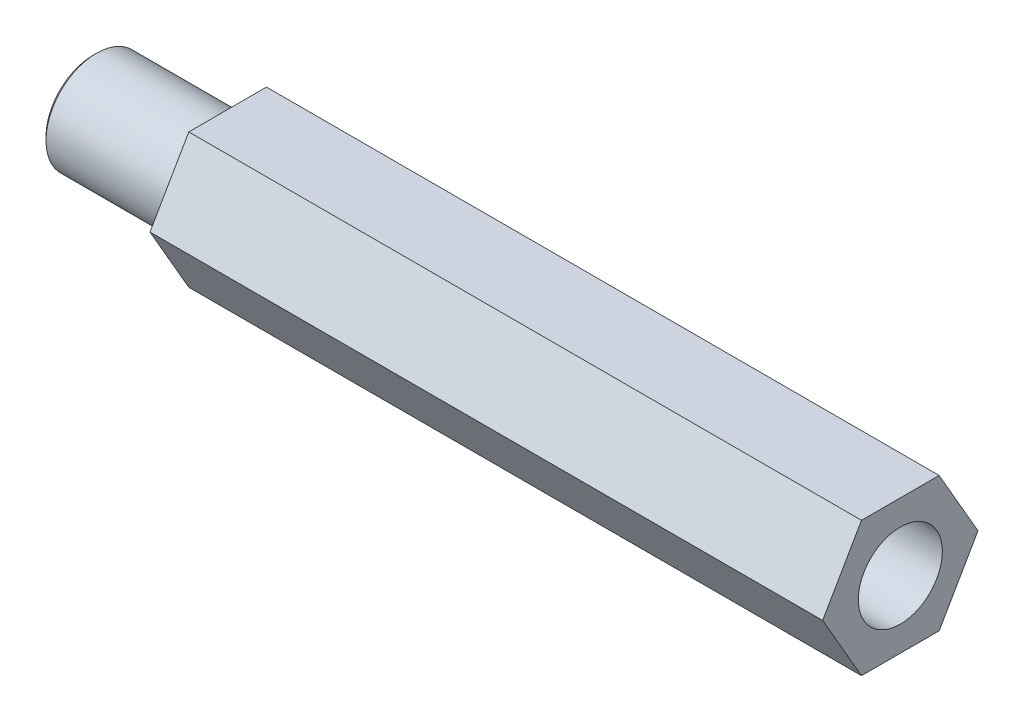
ISO-10303-21;
HEADER;
FILE_DESCRIPTION(('STEP AP214'),'2;1');
FILE_NAME('part.step','',(''),(''),'','','');
FILE_SCHEMA(('AUTOMOTIVE_DESIGN { 1 0 10303 214 1 1 1 1 }'));
ENDSEC;
DATA;
#1=APPLICATION_CONTEXT('core data for automotive mechanical design processes');
#2=APPLICATION_PROTOCOL_DEFINITION('international standard','automotive_design',2000,#1);
#3=PRODUCT_CONTEXT('',#1,'mechanical');
#4=PRODUCT('Part','Part','',(#3));
#5=PRODUCT_RELATED_PRODUCT_CATEGORY('part','',(#4));
#6=PRODUCT_DEFINITION_FORMATION('','',#4);
#7=PRODUCT_DEFINITION_CONTEXT('part definition',#1,'design');
#8=PRODUCT_DEFINITION('design','',#6,#7);
#9=PRODUCT_DEFINITION_SHAPE('','',#8);
#10=(LENGTH_UNIT() NAMED_UNIT(*) SI_UNIT(.MILLI.,.METRE.));
#11=(NAMED_UNIT(*) PLANE_ANGLE_UNIT() SI_UNIT($,.RADIAN.));
#12=(NAMED_UNIT(*) SI_UNIT($,.STERADIAN.) SOLID_ANGLE_UNIT());
#13=UNCERTAINTY_MEASURE_WITH_UNIT(LENGTH_MEASURE(1.E-05),#10,'distance_accuracy_value','');
#14=(GEOMETRIC_REPRESENTATION_CONTEXT(3) GLOBAL_UNCERTAINTY_ASSIGNED_CONTEXT((#13)) GLOBAL_UNIT_ASSIGNED_CONTEXT((#10,
#11,#12)) REPRESENTATION_CONTEXT('',''));
#15=CARTESIAN_POINT('',(0.,0.,0.));
#16=DIRECTION('',(0.,0.,1.));
#17=DIRECTION('',(1.,0.,0.));
#18=AXIS2_PLACEMENT_3D('',#15,#16,#17);
#19=CARTESIAN_POINT('',(0.,0.,0.));
#20=DIRECTION('',(1.,0.,0.));
#21=DIRECTION('',(0.,0.,-1.));
#22=AXIS2_PLACEMENT_3D('',#19,#20,#21);
#23=PLANE('',#22);
#24=DIRECTION('',(0.,0.866025403784439,-0.499999999999999));
#25=VECTOR('',#24,1.);
#26=CARTESIAN_POINT('',(0.,-4.,-2.3094010767585));
#27=LINE('',#26,#25);
#28=CARTESIAN_POINT('',(0.,-4.,-2.3094010767585));
#29=VERTEX_POINT('',#28);
#30=CARTESIAN_POINT('',(0.,0.,-4.618802153517));
#31=VERTEX_POINT('',#30);
#32=EDGE_CURVE('E120',#29,#31,#27,.T.);
#33=ORIENTED_EDGE('',*,*,#32,.F.);
#34=DIRECTION('',(0.,0.,-1.));
#35=VECTOR('',#34,1.);
#36=CARTESIAN_POINT('',(0.,-4.,2.3094010767585));
#37=LINE('',#36,#35);
#38=CARTESIAN_POINT('',(0.,-4.,2.3094010767585));
#39=VERTEX_POINT('',#38);
#40=EDGE_CURVE('E80',#39,#29,#37,.T.);
#41=ORIENTED_EDGE('',*,*,#40,.F.);
#42=DIRECTION('',(0.,-0.866025403784439,-0.5));
#43=VECTOR('',#42,1.);
#44=CARTESIAN_POINT('',(0.,0.,4.61880215351701));
#45=LINE('',#44,#43);
#46=CARTESIAN_POINT('',(0.,0.,4.61880215351701));
#47=VERTEX_POINT('',#46);
#48=EDGE_CURVE('E74',#47,#39,#45,.T.);
#49=ORIENTED_EDGE('',*,*,#48,.F.);
#50=DIRECTION('',(0.,-0.866025403784438,0.5));
#51=VECTOR('',#50,1.);
#52=CARTESIAN_POINT('',(0.,4.,2.3094010767585));
#53=LINE('',#52,#51);
#54=CARTESIAN_POINT('',(0.,4.,2.3094010767585));
#55=VERTEX_POINT('',#54);
#56=EDGE_CURVE('E110',#55,#47,#53,.T.);
#57=ORIENTED_EDGE('',*,*,#56,.F.);
#58=DIRECTION('',(0.,0.,1.));
#59=VECTOR('',#58,1.);
#60=CARTESIAN_POINT('',(0.,4.,-2.3094010767585));
#61=LINE('',#60,#59);
#62=CARTESIAN_POINT('',(0.,4.,-2.3094010767585));
#63=VERTEX_POINT('',#62);
#64=EDGE_CURVE('E126',#63,#55,#61,.T.);
#65=ORIENTED_EDGE('',*,*,#64,.F.);
#66=DIRECTION('',(0.,0.866025403784439,0.5));
#67=VECTOR('',#66,1.);
#68=CARTESIAN_POINT('',(0.,0.,-4.618802153517));
#69=LINE('',#68,#67);
#70=EDGE_CURVE('E123',#31,#63,#69,.T.);
#71=ORIENTED_EDGE('',*,*,#70,.F.);
#72=EDGE_LOOP('',(#33,#41,#49,#57,#65,#71));
#73=FACE_BOUND('',#72,.T.);
#74=CARTESIAN_POINT('',(0.,0.,0.));
#75=DIRECTION('',(1.,0.,0.));
#76=DIRECTION('',(0.,0.,-1.));
#77=AXIS2_PLACEMENT_3D('',#74,#75,#76);
#78=CIRCLE('',#77,3.);
#79=CARTESIAN_POINT('',(0.,0.,-3.));
#80=VERTEX_POINT('',#79);
#81=EDGE_CURVE('E140',#80,#80,#78,.F.);
#82=ORIENTED_EDGE('',*,*,#81,.F.);
#83=EDGE_LOOP('',(#82));
#84=FACE_BOUND('',#83,.T.);
#85=ADVANCED_FACE('F34',(#73,#84),#23,.F.);
#86=CARTESIAN_POINT('',(40.,-4.,-2.3094010767585));
#87=DIRECTION('',(0.,0.5,0.866025403784439));
#88=DIRECTION('',(0.,-0.866025403784439,0.5));
#89=AXIS2_PLACEMENT_3D('',#86,#87,#88);
#90=PLANE('',#89);
#91=ORIENTED_EDGE('',*,*,#32,.T.);
#92=DIRECTION('',(-1.,0.,0.));
#93=VECTOR('',#92,1.);
#94=CARTESIAN_POINT('',(40.,0.,-4.618802153517));
#95=LINE('',#94,#93);
#96=CARTESIAN_POINT('',(40.,0.,-4.618802153517));
#97=VERTEX_POINT('',#96);
#98=EDGE_CURVE('E138',#97,#31,#95,.T.);
#99=ORIENTED_EDGE('',*,*,#98,.F.);
#100=DIRECTION('',(0.,0.866025403784439,-0.499999999999999));
#101=VECTOR('',#100,1.);
#102=CARTESIAN_POINT('',(40.,-4.,-2.3094010767585));
#103=LINE('',#102,#101);
#104=CARTESIAN_POINT('',(40.,-4.,-2.3094010767585));
#105=VERTEX_POINT('',#104);
#106=EDGE_CURVE('E131',#105,#97,#103,.T.);
#107=ORIENTED_EDGE('',*,*,#106,.F.);
#108=DIRECTION('',(-1.,0.,0.));
#109=VECTOR('',#108,1.);
#110=CARTESIAN_POINT('',(40.,-4.,-2.3094010767585));
#111=LINE('',#110,#109);
#112=EDGE_CURVE('E116',#105,#29,#111,.T.);
#113=ORIENTED_EDGE('',*,*,#112,.T.);
#114=EDGE_LOOP('',(#91,#99,#107,#113));
#115=FACE_BOUND('',#114,.T.);
#116=ADVANCED_FACE('F156',(#115),#90,.F.);
#117=CARTESIAN_POINT('',(40.,0.,-4.618802153517));
#118=DIRECTION('',(0.,-0.5,0.866025403784439));
#119=DIRECTION('',(0.,-0.866025403784439,-0.5));
#120=AXIS2_PLACEMENT_3D('',#117,#118,#119);
#121=PLANE('',#120);
#122=ORIENTED_EDGE('',*,*,#70,.T.);
#123=DIRECTION('',(-1.,0.,0.));
#124=VECTOR('',#123,1.);
#125=CARTESIAN_POINT('',(40.,4.,-2.3094010767585));
#126=LINE('',#125,#124);
#127=CARTESIAN_POINT('',(40.,4.,-2.3094010767585));
#128=VERTEX_POINT('',#127);
#129=EDGE_CURVE('E135',#128,#63,#126,.T.);
#130=ORIENTED_EDGE('',*,*,#129,.F.);
#131=DIRECTION('',(0.,0.866025403784439,0.5));
#132=VECTOR('',#131,1.);
#133=CARTESIAN_POINT('',(40.,0.,-4.618802153517));
#134=LINE('',#133,#132);
#135=EDGE_CURVE('E89',#97,#128,#134,.T.);
#136=ORIENTED_EDGE('',*,*,#135,.F.);
#137=ORIENTED_EDGE('',*,*,#98,.T.);
#138=EDGE_LOOP('',(#122,#130,#136,#137));
#139=FACE_BOUND('',#138,.T.);
#140=ADVANCED_FACE('F162',(#139),#121,.F.);
#141=CARTESIAN_POINT('',(40.,4.,-2.3094010767585));
#142=DIRECTION('',(0.,-1.,0.));
#143=DIRECTION('',(0.,0.,-1.));
#144=AXIS2_PLACEMENT_3D('',#141,#142,#143);
#145=PLANE('',#144);
#146=ORIENTED_EDGE('',*,*,#64,.T.);
#147=DIRECTION('',(-1.,0.,0.));
#148=VECTOR('',#147,1.);
#149=CARTESIAN_POINT('',(40.,4.,2.3094010767585));
#150=LINE('',#149,#148);
#151=CARTESIAN_POINT('',(40.,4.,2.3094010767585));
#152=VERTEX_POINT('',#151);
#153=EDGE_CURVE('E111',#152,#55,#150,.T.);
#154=ORIENTED_EDGE('',*,*,#153,.F.);
#155=DIRECTION('',(0.,0.,1.));
#156=VECTOR('',#155,1.);
#157=CARTESIAN_POINT('',(40.,4.,-2.3094010767585));
#158=LINE('',#157,#156);
#159=EDGE_CURVE('E102',#128,#152,#158,.T.);
#160=ORIENTED_EDGE('',*,*,#159,.F.);
#161=ORIENTED_EDGE('',*,*,#129,.T.);
#162=EDGE_LOOP('',(#146,#154,#160,#161));
#163=FACE_BOUND('',#162,.T.);
#164=ADVANCED_FACE('F176',(#163),#145,.F.);
#165=CARTESIAN_POINT('',(40.,4.,2.3094010767585));
#166=DIRECTION('',(0.,-0.5,-0.866025403784439));
#167=DIRECTION('',(0.,0.866025403784439,-0.5));
#168=AXIS2_PLACEMENT_3D('',#165,#166,#167);
#169=PLANE('',#168);
#170=ORIENTED_EDGE('',*,*,#56,.T.);
#171=DIRECTION('',(-1.,0.,0.));
#172=VECTOR('',#171,1.);
#173=CARTESIAN_POINT('',(40.,0.,4.61880215351701));
#174=LINE('',#173,#172);
#175=CARTESIAN_POINT('',(40.,0.,4.61880215351701));
#176=VERTEX_POINT('',#175);
#177=EDGE_CURVE('E107',#176,#47,#174,.T.);
#178=ORIENTED_EDGE('',*,*,#177,.F.);
#179=DIRECTION('',(0.,-0.866025403784438,0.5));
#180=VECTOR('',#179,1.);
#181=CARTESIAN_POINT('',(40.,4.,2.3094010767585));
#182=LINE('',#181,#180);
#183=EDGE_CURVE('E96',#152,#176,#182,.T.);
#184=ORIENTED_EDGE('',*,*,#183,.F.);
#185=ORIENTED_EDGE('',*,*,#153,.T.);
#186=EDGE_LOOP('',(#170,#178,#184,#185));
#187=FACE_BOUND('',#186,.T.);
#188=ADVANCED_FACE('F108',(#187),#169,.F.);
#189=CARTESIAN_POINT('',(40.,0.,4.61880215351701));
#190=DIRECTION('',(0.,0.5,-0.866025403784439));
#191=DIRECTION('',(0.,0.866025403784439,0.5));
#192=AXIS2_PLACEMENT_3D('',#189,#190,#191);
#193=PLANE('',#192);
#194=ORIENTED_EDGE('',*,*,#48,.T.);
#195=DIRECTION('',(-1.,0.,0.));
#196=VECTOR('',#195,1.);
#197=CARTESIAN_POINT('',(40.,-4.,2.3094010767585));
#198=LINE('',#197,#196);
#199=CARTESIAN_POINT('',(40.,-4.,2.3094010767585));
#200=VERTEX_POINT('',#199);
#201=EDGE_CURVE('E112',#200,#39,#198,.T.);
#202=ORIENTED_EDGE('',*,*,#201,.F.);
#203=DIRECTION('',(0.,-0.866025403784439,-0.5));
#204=VECTOR('',#203,1.);
#205=CARTESIAN_POINT('',(40.,0.,4.61880215351701));
#206=LINE('',#205,#204);
#207=EDGE_CURVE('E100',#176,#200,#206,.T.);
#208=ORIENTED_EDGE('',*,*,#207,.F.);
#209=ORIENTED_EDGE('',*,*,#177,.T.);
#210=EDGE_LOOP('',(#194,#202,#208,#209));
#211=FACE_BOUND('',#210,.T.);
#212=ADVANCED_FACE('F114',(#211),#193,.F.);
#213=CARTESIAN_POINT('',(40.,-4.,2.3094010767585));
#214=DIRECTION('',(0.,1.,0.));
#215=DIRECTION('',(0.,0.,1.));
#216=AXIS2_PLACEMENT_3D('',#213,#214,#215);
#217=PLANE('',#216);
#218=ORIENTED_EDGE('',*,*,#40,.T.);
#219=ORIENTED_EDGE('',*,*,#112,.F.);
#220=DIRECTION('',(0.,0.,-1.));
#221=VECTOR('',#220,1.);
#222=CARTESIAN_POINT('',(40.,-4.,2.3094010767585));
#223=LINE('',#222,#221);
#224=EDGE_CURVE('E51',#200,#105,#223,.T.);
#225=ORIENTED_EDGE('',*,*,#224,.F.);
#226=ORIENTED_EDGE('',*,*,#201,.T.);
#227=EDGE_LOOP('',(#218,#219,#225,#226));
#228=FACE_BOUND('',#227,.T.);
#229=ADVANCED_FACE('F169',(#228),#217,.F.);
#230=CARTESIAN_POINT('',(40.,0.,0.));
#231=DIRECTION('',(1.,0.,0.));
#232=DIRECTION('',(0.,0.,-1.));
#233=AXIS2_PLACEMENT_3D('',#230,#231,#232);
#234=PLANE('',#233);
#235=CARTESIAN_POINT('',(40.,0.,0.));
#236=DIRECTION('',(1.,0.,0.));
#237=DIRECTION('',(0.,0.,-1.));
#238=AXIS2_PLACEMENT_3D('',#235,#236,#237);
#239=CIRCLE('',#238,2.5);
#240=CARTESIAN_POINT('',(40.,0.,-2.5));
#241=VERTEX_POINT('',#240);
#242=EDGE_CURVE('E189',#241,#241,#239,.T.);
#243=ORIENTED_EDGE('',*,*,#242,.F.);
#244=EDGE_LOOP('',(#243));
#245=FACE_BOUND('',#244,.T.);
#246=ORIENTED_EDGE('',*,*,#106,.T.);
#247=ORIENTED_EDGE('',*,*,#135,.T.);
#248=ORIENTED_EDGE('',*,*,#159,.T.);
#249=ORIENTED_EDGE('',*,*,#183,.T.);
#250=ORIENTED_EDGE('',*,*,#207,.T.);
#251=ORIENTED_EDGE('',*,*,#224,.T.);
#252=EDGE_LOOP('',(#246,#247,#248,#249,#250,#251));
#253=FACE_BOUND('',#252,.T.);
#254=ADVANCED_FACE('F98',(#245,#253),#234,.T.);
#255=CARTESIAN_POINT('',(28.,0.,0.));
#256=DIRECTION('',(1.,0.,0.));
#257=DIRECTION('',(0.,0.,-1.));
#258=AXIS2_PLACEMENT_3D('',#255,#256,#257);
#259=CYLINDRICAL_SURFACE('',#258,2.5);
#260=CARTESIAN_POINT('',(28.,0.,0.));
#261=DIRECTION('',(1.,0.,0.));
#262=DIRECTION('',(0.,0.,-1.));
#263=AXIS2_PLACEMENT_3D('',#260,#261,#262);
#264=CIRCLE('',#263,2.5);
#265=CARTESIAN_POINT('',(28.,0.,-2.5));
#266=VERTEX_POINT('',#265);
#267=EDGE_CURVE('E124',#266,#266,#264,.T.);
#268=ORIENTED_EDGE('',*,*,#267,.F.);
#269=EDGE_LOOP('',(#268));
#270=FACE_BOUND('',#269,.T.);
#271=ORIENTED_EDGE('',*,*,#242,.T.);
#272=EDGE_LOOP('',(#271));
#273=FACE_BOUND('',#272,.T.);
#274=ADVANCED_FACE('F197',(#270,#273),#259,.F.);
#275=CARTESIAN_POINT('',(28.,0.,0.));
#276=DIRECTION('',(1.,0.,0.));
#277=DIRECTION('',(0.,0.,-1.));
#278=AXIS2_PLACEMENT_3D('',#275,#276,#277);
#279=PLANE('',#278);
#280=ORIENTED_EDGE('',*,*,#267,.T.);
#281=EDGE_LOOP('',(#280));
#282=FACE_BOUND('',#281,.T.);
#283=ADVANCED_FACE('F195',(#282),#279,.T.);
#284=CARTESIAN_POINT('',(-8.,0.,0.));
#285=DIRECTION('',(1.,0.,0.));
#286=DIRECTION('',(0.,0.,-1.));
#287=AXIS2_PLACEMENT_3D('',#284,#285,#286);
#288=CYLINDRICAL_SURFACE('',#287,3.);
#289=CARTESIAN_POINT('',(-7.8,0.,0.));
#290=DIRECTION('',(-1.,0.,0.));
#291=DIRECTION('',(0.,0.,1.));
#292=AXIS2_PLACEMENT_3D('',#289,#290,#291);
#293=CIRCLE('',#292,3.);
#294=CARTESIAN_POINT('',(-7.8,0.,3.));
#295=VERTEX_POINT('',#294);
#296=EDGE_CURVE('E11',#295,#295,#293,.F.);
#297=ORIENTED_EDGE('',*,*,#296,.T.);
#298=EDGE_LOOP('',(#297));
#299=FACE_BOUND('',#298,.T.);
#300=ORIENTED_EDGE('',*,*,#81,.T.);
#301=EDGE_LOOP('',(#300));
#302=FACE_BOUND('',#301,.T.);
#303=ADVANCED_FACE('F152',(#299,#302),#288,.T.);
#304=CARTESIAN_POINT('',(-8.,0.,0.));
#305=DIRECTION('',(-1.,0.,0.));
#306=DIRECTION('',(0.,0.,1.));
#307=AXIS2_PLACEMENT_3D('',#304,#305,#306);
#308=PLANE('',#307);
#309=CARTESIAN_POINT('',(-8.,0.,0.));
#310=DIRECTION('',(-1.,0.,0.));
#311=DIRECTION('',(0.,0.,1.));
#312=AXIS2_PLACEMENT_3D('',#309,#310,#311);
#313=CIRCLE('',#312,2.8);
#314=CARTESIAN_POINT('',(-8.,0.,2.8));
#315=VERTEX_POINT('',#314);
#316=EDGE_CURVE('E43',#315,#315,#313,.T.);
#317=ORIENTED_EDGE('',*,*,#316,.T.);
#318=EDGE_LOOP('',(#317));
#319=FACE_BOUND('',#318,.T.);
#320=ADVANCED_FACE('F145',(#319),#308,.T.);
#321=CARTESIAN_POINT('',(-8.,0.,0.));
#322=DIRECTION('',(1.,0.,0.));
#323=DIRECTION('',(0.,0.,-1.));
#324=AXIS2_PLACEMENT_3D('',#321,#322,#323);
#325=CONICAL_SURFACE('',#324,2.8,0.785398163397443);
#326=ORIENTED_EDGE('',*,*,#296,.F.);
#327=EDGE_LOOP('',(#326));
#328=FACE_BOUND('',#327,.T.);
#329=ORIENTED_EDGE('',*,*,#316,.F.);
#330=EDGE_LOOP('',(#329));
#331=FACE_BOUND('',#330,.T.);
#332=ADVANCED_FACE('F36',(#328,#331),#325,.T.);
#333=CLOSED_SHELL('',(#85,#116,#140,#164,#188,#212,#229,#254,#274,#283,#303,#320,#332));
#334=MANIFOLD_SOLID_BREP('B2',#333);
#335=ADVANCED_BREP_SHAPE_REPRESENTATION('',(#18,#334),#14);
#336=SHAPE_DEFINITION_REPRESENTATION(#9,#335);
ENDSEC;
END-ISO-10303-21;
